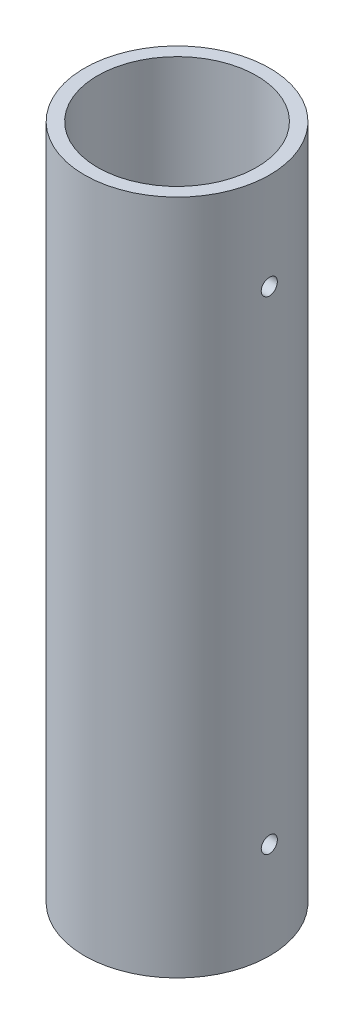
ISO-10303-21;
HEADER;
FILE_DESCRIPTION(('STEP AP214'),'2;1');
FILE_NAME('part.step','',(''),(''),'','','');
FILE_SCHEMA(('AUTOMOTIVE_DESIGN { 1 0 10303 214 1 1 1 1 }'));
ENDSEC;
DATA;
#1=APPLICATION_CONTEXT('core data for automotive mechanical design processes');
#2=APPLICATION_PROTOCOL_DEFINITION('international standard','automotive_design',2000,#1);
#3=PRODUCT_CONTEXT('',#1,'mechanical');
#4=PRODUCT('Part','Part','',(#3));
#5=PRODUCT_RELATED_PRODUCT_CATEGORY('part','',(#4));
#6=PRODUCT_DEFINITION_FORMATION('','',#4);
#7=PRODUCT_DEFINITION_CONTEXT('part definition',#1,'design');
#8=PRODUCT_DEFINITION('design','',#6,#7);
#9=PRODUCT_DEFINITION_SHAPE('','',#8);
#10=(LENGTH_UNIT() NAMED_UNIT(*) SI_UNIT(.MILLI.,.METRE.));
#11=(NAMED_UNIT(*) PLANE_ANGLE_UNIT() SI_UNIT($,.RADIAN.));
#12=(NAMED_UNIT(*) SI_UNIT($,.STERADIAN.) SOLID_ANGLE_UNIT());
#13=UNCERTAINTY_MEASURE_WITH_UNIT(LENGTH_MEASURE(1.E-05),#10,'distance_accuracy_value','');
#14=(GEOMETRIC_REPRESENTATION_CONTEXT(3) GLOBAL_UNCERTAINTY_ASSIGNED_CONTEXT((#13)) GLOBAL_UNIT_ASSIGNED_CONTEXT((#10,
#11,#12)) REPRESENTATION_CONTEXT('',''));
#15=CARTESIAN_POINT('',(0.,0.,0.));
#16=DIRECTION('',(0.,0.,1.));
#17=DIRECTION('',(1.,0.,0.));
#18=AXIS2_PLACEMENT_3D('',#15,#16,#17);
#19=CARTESIAN_POINT('',(0.,-266.7,-1.11022302462516E-13));
#20=DIRECTION('',(0.,0.999999999999993,0.));
#21=DIRECTION('',(0.,0.,0.999999999999993));
#22=AXIS2_PLACEMENT_3D('',#19,#20,#21);
#23=CYLINDRICAL_SURFACE('',#22,36.5125);
#24=CARTESIAN_POINT('',(36.3741945787119,-38.1000000000011,-3.17499999999965));
#25=CARTESIAN_POINT('',(36.3741964069724,-37.9220209484427,-3.17499223767874));
#26=CARTESIAN_POINT('',(36.3755149217874,-37.7439214348147,-3.15998434628701));
#27=CARTESIAN_POINT('',(36.3806463320211,-37.3926522233594,-3.10033709359486));
#28=CARTESIAN_POINT('',(36.3844620380761,-37.2194883100919,-3.05566434309936));
#29=CARTESIAN_POINT('',(36.394152413395,-36.8832285716402,-2.93799093118499));
#30=CARTESIAN_POINT('',(36.4000258988483,-36.7201270210372,-2.86500655445213));
#31=CARTESIAN_POINT('',(36.4131685644205,-36.4085275204711,-2.69281109939546));
#32=CARTESIAN_POINT('',(36.4204374503569,-36.2600265023422,-2.59360554743766));
#33=CARTESIAN_POINT('',(36.4355745979225,-35.9813920765214,-2.37148592362376));
#34=CARTESIAN_POINT('',(36.4434442954007,-35.8513049339295,-2.24851390777006));
#35=CARTESIAN_POINT('',(36.4588832259313,-35.613588625558,-1.98247498338722));
#36=CARTESIAN_POINT('',(36.466452445721,-35.5059604501944,-1.83940718912148));
#37=CARTESIAN_POINT('',(36.4804513186563,-35.3160618687433,-1.53696010977603));
#38=CARTESIAN_POINT('',(36.4868791559379,-35.2338317182659,-1.37755545804974));
#39=CARTESIAN_POINT('',(36.4978555128193,-35.0973208939234,-1.04713634475513));
#40=CARTESIAN_POINT('',(36.5024040679158,-35.0430396921409,-0.87612210254515));
#41=CARTESIAN_POINT('',(36.5090993166084,-34.9641014043957,-0.527800548334798));
#42=CARTESIAN_POINT('',(36.5112521015269,-34.9393691773712,-0.350510384093045));
#43=CARTESIAN_POINT('',(36.5129339083785,-34.919998566389,0.00571683553830769));
#44=CARTESIAN_POINT('',(36.5124629829949,-34.9253595781698,0.184653857787553));
#45=CARTESIAN_POINT('',(36.5089554471739,-34.9659619065122,0.538585809560891));
#46=CARTESIAN_POINT('',(36.5059257748989,-35.0011224212273,0.713590086833769));
#47=CARTESIAN_POINT('',(36.4976494344219,-35.1001999894299,1.0552037567847));
#48=CARTESIAN_POINT('',(36.4924027435441,-35.1641173370455,1.22181306357867));
#49=CARTESIAN_POINT('',(36.4802706070642,-35.3189839523703,1.5421639969502));
#50=CARTESIAN_POINT('',(36.4733829754146,-35.4099693204288,1.69588808546635));
#51=CARTESIAN_POINT('',(36.4587427444671,-35.6163630245248,1.98591351092084));
#52=CARTESIAN_POINT('',(36.4509901260433,-35.7317719006428,2.12221446247202));
#53=CARTESIAN_POINT('',(36.4354606495048,-35.9841917951939,2.37399713886373));
#54=CARTESIAN_POINT('',(36.4276837960808,-36.1212730413492,2.48940847013833));
#55=CARTESIAN_POINT('',(36.4130081143365,-36.4129019548663,2.69559172673827));
#56=CARTESIAN_POINT('',(36.4061092868369,-36.5674496385539,2.78636362903308));
#57=CARTESIAN_POINT('',(36.3939696389523,-36.8896747549541,2.94068913898403));
#58=CARTESIAN_POINT('',(36.388729049679,-37.0573540137784,3.00423895308614));
#59=CARTESIAN_POINT('',(36.3805038227307,-37.4010582653507,3.10226350008524));
#60=CARTESIAN_POINT('',(36.3775191333504,-37.5770830667204,3.1367388993705));
#61=CARTESIAN_POINT('',(36.3741521666384,-37.9318653246311,3.17554658314364));
#62=CARTESIAN_POINT('',(36.3737614088203,-38.1106119593938,3.17997709609324));
#63=CARTESIAN_POINT('',(36.3756041671422,-38.4663053373545,3.15882668312564));
#64=CARTESIAN_POINT('',(36.3778376565952,-38.6432520988376,3.13324606240327));
#65=CARTESIAN_POINT('',(36.3846695239537,-38.9900399900931,3.05288147123359));
#66=CARTESIAN_POINT('',(36.389264179366,-39.1598918509087,2.99814346387842));
#67=CARTESIAN_POINT('',(36.4002976067163,-39.4880011145497,2.86106467628365));
#68=CARTESIAN_POINT('',(36.4067364108219,-39.646258315068,2.77872341455431));
#69=CARTESIAN_POINT('',(36.4207532017477,-39.9471350598904,2.58852742866517));
#70=CARTESIAN_POINT('',(36.4283340895122,-40.0897131355067,2.48060732097235));
#71=CARTESIAN_POINT('',(36.4437711314693,-40.3547649615016,2.24241138363842));
#72=CARTESIAN_POINT('',(36.4516272908142,-40.4772383353415,2.11213513538498));
#73=CARTESIAN_POINT('',(36.4667550092637,-40.6989401730446,1.83250016835367));
#74=CARTESIAN_POINT('',(36.4740249269046,-40.7981047627762,1.68309070747005));
#75=CARTESIAN_POINT('',(36.4871373336795,-40.9699355930353,1.36968288323859));
#76=CARTESIAN_POINT('',(36.4929798381626,-41.042602118502,1.20568467679011));
#77=CARTESIAN_POINT('',(36.5025716028831,-41.1592646848333,0.867982349778373));
#78=CARTESIAN_POINT('',(36.5063237323204,-41.2033000381238,0.694291894857699));
#79=CARTESIAN_POINT('',(36.511323659952,-41.2615787077319,0.34194856943701));
#80=CARTESIAN_POINT('',(36.5125715101824,-41.2758226430812,0.163295802126354));
#81=CARTESIAN_POINT('',(36.5124223397014,-41.2741066310721,-0.193271691564553));
#82=CARTESIAN_POINT('',(36.511034028917,-41.258246149358,-0.371186908713194));
#83=CARTESIAN_POINT('',(36.5057857381011,-41.196979177349,-0.721816344792293));
#84=CARTESIAN_POINT('',(36.501925754965,-41.1515726499427,-0.894530557189691));
#85=CARTESIAN_POINT('',(36.492167080476,-41.0325282743742,-1.22986020903324));
#86=CARTESIAN_POINT('',(36.4862685353901,-40.9588924516247,-1.39247637202792));
#87=CARTESIAN_POINT('',(36.473092152623,-40.7854909215865,-1.70305476347802));
#88=CARTESIAN_POINT('',(36.4658143339545,-40.6857255744766,-1.85101719388706));
#89=CARTESIAN_POINT('',(36.4506672987472,-40.4625234690787,-2.12859732583253));
#90=CARTESIAN_POINT('',(36.4427962875014,-40.339012966056,-2.2581556313287));
#91=CARTESIAN_POINT('',(36.4273652627132,-40.0719630884367,-2.49475723007935));
#92=CARTESIAN_POINT('',(36.4198053248018,-39.9284188798808,-2.60179507366438));
#93=CARTESIAN_POINT('',(36.4058360205555,-39.6250736854981,-2.79047604272186));
#94=CARTESIAN_POINT('',(36.3994289930184,-39.4652406618243,-2.87206778845395));
#95=CARTESIAN_POINT('',(36.388519306995,-39.1341952474858,-3.00715047911602));
#96=CARTESIAN_POINT('',(36.3840144685756,-38.9629961444134,-3.06067360815973));
#97=CARTESIAN_POINT('',(36.3785732488344,-38.6756625224093,-3.12452531560611));
#98=CARTESIAN_POINT('',(36.3769388392626,-38.5613738775411,-3.14342801946827));
#99=CARTESIAN_POINT('',(36.3747489114024,-38.3314071299448,-3.16866786665855));
#100=CARTESIAN_POINT('',(36.3741933899045,-38.2157290313512,-3.17500504736827));
#101=CARTESIAN_POINT('',(36.3741945787119,-38.1000000000011,-3.17499999999965));
#102=B_SPLINE_CURVE_WITH_KNOTS('',3,(#24,#25,#26,#27,#28,#29,#30,#31,#32,#33,#34,#35,#36,#37,
#38,#39,#40,#41,#42,#43,#44,#45,#46,#47,#48,#49,#50,#51,#52,#53,#54,#55,#56,#57,#58,#59,#60,#61,
#62,#63,#64,#65,#66,#67,#68,#69,#70,#71,#72,#73,#74,#75,#76,#77,#78,#79,#80,#81,#82,#83,#84,#85,
#86,#87,#88,#89,#90,#91,#92,#93,#94,#95,#96,#97,#98,#99,#100,#101),.UNSPECIFIED.,.T.,.F.,(4,2,2,
2,2,2,2,2,2,2,2,2,2,2,2,2,2,2,2,2,2,2,2,2,2,2,2,2,2,2,2,2,2,2,2,2,2,2,4),(0.,0.533514591677766,
1.0676306992763,1.60144004079251,2.13513696641946,2.67015187512738,3.20519037242478,
3.74107259928876,4.27694470369942,4.81145120102616,5.34594696569034,5.87899805596258,
6.41205459846518,6.94582528484502,7.47960777580354,8.01515680663147,8.55070633803687,
9.08633047707911,9.62194233923339,10.1558022292963,10.6896566903783,11.2226720742265,
11.7556967560652,12.2900989127025,12.8245110769591,13.3603710727916,13.8962253062417,
14.4313422151079,14.9664480047442,15.4997888703335,16.0331304058322,16.566433681979,
17.0997296072673,17.6347093425764,18.169818387756,18.7060010111152,19.241567483591,
19.5884808424829,19.9353931693288),.UNSPECIFIED.);
#103=CARTESIAN_POINT('',(36.3741945787119,-38.1000000000011,-3.17499999999965));
#104=VERTEX_POINT('',#103);
#105=EDGE_CURVE('E100',#104,#104,#102,.T.);
#106=ORIENTED_EDGE('',*,*,#105,.F.);
#107=EDGE_LOOP('',(#106));
#108=FACE_BOUND('',#107,.T.);
#109=CARTESIAN_POINT('',(36.374194578712,-228.6,-3.17499999999976));
#110=CARTESIAN_POINT('',(36.3741964069725,-228.422020948442,-3.17499223767897));
#111=CARTESIAN_POINT('',(36.3755149217874,-228.243921434814,-3.15998434628718));
#112=CARTESIAN_POINT('',(36.380646332021,-227.892652223358,-3.10033709359495));
#113=CARTESIAN_POINT('',(36.3844620380761,-227.71948831009,-3.05566434309942));
#114=CARTESIAN_POINT('',(36.3941524133951,-227.383228571638,-2.93799093118513));
#115=CARTESIAN_POINT('',(36.4000258988484,-227.220127021035,-2.86500655445243));
#116=CARTESIAN_POINT('',(36.4131685644204,-226.90852752047,-2.69281109939524));
#117=CARTESIAN_POINT('',(36.4204374503569,-226.760026502342,-2.59360554743677));
#118=CARTESIAN_POINT('',(36.4355745979225,-226.481392076521,-2.37148592362293));
#119=CARTESIAN_POINT('',(36.4434442954007,-226.351304933928,-2.24851390776999));
#120=CARTESIAN_POINT('',(36.4588832259313,-226.113588625557,-1.98247498338781));
#121=CARTESIAN_POINT('',(36.466452445721,-226.005960450194,-1.839407189122));
#122=CARTESIAN_POINT('',(36.4804513186562,-225.816061868742,-1.53696010977675));
#123=CARTESIAN_POINT('',(36.4868791559379,-225.733831718265,-1.37755545805073));
#124=CARTESIAN_POINT('',(36.4978555128193,-225.597320893923,-1.04713634475617));
#125=CARTESIAN_POINT('',(36.5024040679158,-225.543039692141,-0.876122102545967));
#126=CARTESIAN_POINT('',(36.5090993166085,-225.464101404395,-0.527800548335387));
#127=CARTESIAN_POINT('',(36.5112521015269,-225.43936917737,-0.350510384093622));
#128=CARTESIAN_POINT('',(36.5129339083785,-225.419998566388,0.00571683553777545));
#129=CARTESIAN_POINT('',(36.5124629829949,-225.425359578169,0.184653857787053));
#130=CARTESIAN_POINT('',(36.5089554471739,-225.465961906512,0.538585809560779));
#131=CARTESIAN_POINT('',(36.5059257748988,-225.501122421226,0.713590086834011));
#132=CARTESIAN_POINT('',(36.4976494344219,-225.600199989429,1.05520375678501));
#133=CARTESIAN_POINT('',(36.4924027435441,-225.664117337046,1.22181306357869));
#134=CARTESIAN_POINT('',(36.4802706070641,-225.818983952371,1.54216399695044));
#135=CARTESIAN_POINT('',(36.4733829754145,-225.909969320428,1.69588808546711));
#136=CARTESIAN_POINT('',(36.458742744467,-226.116363024524,1.98591351092186));
#137=CARTESIAN_POINT('',(36.4509901260434,-226.231771900642,2.12221446247277));
#138=CARTESIAN_POINT('',(36.4354606495048,-226.484191795193,2.37399713886433));
#139=CARTESIAN_POINT('',(36.4276837960807,-226.621273041348,2.48940847013902));
#140=CARTESIAN_POINT('',(36.4130081143367,-226.912901954866,2.69559172673837));
#141=CARTESIAN_POINT('',(36.4061092868375,-227.067449638554,2.78636362903247));
#142=CARTESIAN_POINT('',(36.3939696389529,-227.389674754954,2.94068913898345));
#143=CARTESIAN_POINT('',(36.388729049679,-227.557354013778,3.00423895308629));
#144=CARTESIAN_POINT('',(36.3805038227306,-227.90105826535,3.10226350008557));
#145=CARTESIAN_POINT('',(36.3775191333509,-228.07708306672,3.13673889937026));
#146=CARTESIAN_POINT('',(36.374152166639,-228.431865324631,3.17554658314299));
#147=CARTESIAN_POINT('',(36.3737614088206,-228.610611959394,3.17997709609273));
#148=CARTESIAN_POINT('',(36.375604167142,-228.966305337355,3.15882668312574));
#149=CARTESIAN_POINT('',(36.3778376565948,-229.143252098838,3.13324606240385));
#150=CARTESIAN_POINT('',(36.3846695239533,-229.490039990093,3.05288147123406));
#151=CARTESIAN_POINT('',(36.3892641793659,-229.659891850908,2.99814346387833));
#152=CARTESIAN_POINT('',(36.4002976067164,-229.988001114549,2.861064676283));
#153=CARTESIAN_POINT('',(36.4067364108221,-230.146258315067,2.77872341455362));
#154=CARTESIAN_POINT('',(36.4207532017478,-230.447135059889,2.58852742866445));
#155=CARTESIAN_POINT('',(36.4283340895122,-230.589713135506,2.4806073209716));
#156=CARTESIAN_POINT('',(36.4437711314693,-230.854764961501,2.24241138363774));
#157=CARTESIAN_POINT('',(36.4516272908142,-230.977238335341,2.11213513538441));
#158=CARTESIAN_POINT('',(36.4667550092637,-231.198940173044,1.83250016835297));
#159=CARTESIAN_POINT('',(36.4740249269046,-231.298104762775,1.68309070746917));
#160=CARTESIAN_POINT('',(36.4871373336795,-231.469935593034,1.36968288323808));
#161=CARTESIAN_POINT('',(36.4929798381626,-231.542602118502,1.20568467679015));
#162=CARTESIAN_POINT('',(36.5025716028831,-231.659264684833,0.867982349778619));
#163=CARTESIAN_POINT('',(36.5063237323204,-231.703300038122,0.694291894857583));
#164=CARTESIAN_POINT('',(36.511323659952,-231.761578707731,0.341948569436542));
#165=CARTESIAN_POINT('',(36.5125715101824,-231.775822643081,0.163295802125897));
#166=CARTESIAN_POINT('',(36.5124223397014,-231.774106631072,-0.19327169156468));
#167=CARTESIAN_POINT('',(36.511034028917,-231.758246149357,-0.371186908713002));
#168=CARTESIAN_POINT('',(36.5057857381011,-231.696979177348,-0.721816344791825));
#169=CARTESIAN_POINT('',(36.501925754965,-231.651572649942,-0.894530557189267));
#170=CARTESIAN_POINT('',(36.492167080476,-231.532528274374,-1.22986020903271));
#171=CARTESIAN_POINT('',(36.4862685353901,-231.458892451624,-1.39247637202722));
#172=CARTESIAN_POINT('',(36.473092152623,-231.285490921585,-1.70305476347773));
#173=CARTESIAN_POINT('',(36.4658143339546,-231.185725574476,-1.85101719388734));
#174=CARTESIAN_POINT('',(36.4506672987472,-230.962523469078,-2.12859732583268));
#175=CARTESIAN_POINT('',(36.4427962875014,-230.839012966055,-2.25815563132819));
#176=CARTESIAN_POINT('',(36.4273652627133,-230.571963088436,-2.49475723007872));
#177=CARTESIAN_POINT('',(36.4198053248019,-230.428418879881,-2.60179507366429));
#178=CARTESIAN_POINT('',(36.4058360205556,-230.125073685499,-2.79047604272182));
#179=CARTESIAN_POINT('',(36.3994289930184,-229.965240661824,-2.87206778845336));
#180=CARTESIAN_POINT('',(36.388519306995,-229.634195247486,-3.00715047911568));
#181=CARTESIAN_POINT('',(36.3840144685758,-229.462996144413,-3.06067360816018));
#182=CARTESIAN_POINT('',(36.3785732488345,-229.175662522409,-3.12452531560655));
#183=CARTESIAN_POINT('',(36.3769388392626,-229.061373877541,-3.14342801946837));
#184=CARTESIAN_POINT('',(36.3747489114024,-228.831407129944,-3.16866786665845));
#185=CARTESIAN_POINT('',(36.3741933899045,-228.715729031351,-3.17500504736831));
#186=CARTESIAN_POINT('',(36.374194578712,-228.6,-3.17499999999976));
#187=B_SPLINE_CURVE_WITH_KNOTS('',3,(#109,#110,#111,#112,#113,#114,#115,#116,#117,#118,#119,
#120,#121,#122,#123,#124,#125,#126,#127,#128,#129,#130,#131,#132,#133,#134,#135,#136,#137,#138,
#139,#140,#141,#142,#143,#144,#145,#146,#147,#148,#149,#150,#151,#152,#153,#154,#155,#156,#157,
#158,#159,#160,#161,#162,#163,#164,#165,#166,#167,#168,#169,#170,#171,#172,#173,#174,#175,#176,
#177,#178,#179,#180,#181,#182,#183,#184,#185,#186),.UNSPECIFIED.,.T.,.F.,(4,2,2,2,2,2,2,2,2,2,2,
2,2,2,2,2,2,2,2,2,2,2,2,2,2,2,2,2,2,2,2,2,2,2,2,2,2,2,4),(0.,0.533514591678455,1.06763069927752,
1.60144004079339,2.13513696642024,2.6701518751278,3.20519037242459,3.7410725992883,
4.27694470369893,4.81145120102612,5.34594696569051,5.87899805596313,6.41205459846636,
6.94582528484622,7.4796077758045,8.01515680663226,8.55070633803769,9.08633047708017,
9.62194233923461,10.1558022292975,10.6896566903794,11.222672074227,11.7556967560652,
12.2900989127032,12.8245110769603,13.3603710727921,13.8962253062416,14.4313422151082,
14.9664480047447,15.4997888703333,16.0331304058314,16.5664336819788,17.0997296072676,
17.634709342576,18.1698183877549,18.7060010111144,19.2415674835905,19.5884808424826,
19.9353931693288),.UNSPECIFIED.);
#188=CARTESIAN_POINT('',(36.374194578712,-228.6,-3.17499999999976));
#189=VERTEX_POINT('',#188);
#190=EDGE_CURVE('E53',#189,#189,#187,.T.);
#191=ORIENTED_EDGE('',*,*,#190,.F.);
#192=EDGE_LOOP('',(#191));
#193=FACE_BOUND('',#192,.T.);
#194=CARTESIAN_POINT('',(0.,-266.7,-1.11022302462516E-13));
#195=DIRECTION('',(0.,0.999999999999993,0.));
#196=DIRECTION('',(0.,0.,0.999999999999993));
#197=AXIS2_PLACEMENT_3D('',#194,#195,#196);
#198=CIRCLE('',#197,36.5125);
#199=CARTESIAN_POINT('',(0.,-266.7,36.5124999999996));
#200=VERTEX_POINT('',#199);
#201=EDGE_CURVE('E10',#200,#200,#198,.T.);
#202=ORIENTED_EDGE('',*,*,#201,.T.);
#203=EDGE_LOOP('',(#202));
#204=FACE_BOUND('',#203,.T.);
#205=CARTESIAN_POINT('',(0.,0.,0.));
#206=DIRECTION('',(0.,0.999999999999993,0.));
#207=DIRECTION('',(0.,0.,0.999999999999993));
#208=AXIS2_PLACEMENT_3D('',#205,#206,#207);
#209=CIRCLE('',#208,36.5125);
#210=CARTESIAN_POINT('',(0.,0.,36.5124999999997));
#211=VERTEX_POINT('',#210);
#212=EDGE_CURVE('E41',#211,#211,#209,.T.);
#213=ORIENTED_EDGE('',*,*,#212,.F.);
#214=EDGE_LOOP('',(#213));
#215=FACE_BOUND('',#214,.T.);
#216=ADVANCED_FACE('F37',(#108,#193,#204,#215),#23,.T.);
#217=CARTESIAN_POINT('',(0.,-266.7,-1.11022302462516E-13));
#218=DIRECTION('',(0.,0.999999999999993,0.));
#219=DIRECTION('',(0.,0.,0.999999999999993));
#220=AXIS2_PLACEMENT_3D('',#217,#218,#219);
#221=PLANE('',#220);
#222=CARTESIAN_POINT('',(0.,-266.7,-1.11022302462516E-13));
#223=DIRECTION('',(0.,0.999999999999993,0.));
#224=DIRECTION('',(0.,0.,0.999999999999993));
#225=AXIS2_PLACEMENT_3D('',#222,#223,#224);
#226=CIRCLE('',#225,31.3563);
#227=CARTESIAN_POINT('',(0.,-266.7,31.3562999999997));
#228=VERTEX_POINT('',#227);
#229=EDGE_CURVE('E48',#228,#228,#226,.T.);
#230=ORIENTED_EDGE('',*,*,#229,.T.);
#231=EDGE_LOOP('',(#230));
#232=FACE_BOUND('',#231,.T.);
#233=ORIENTED_EDGE('',*,*,#201,.F.);
#234=EDGE_LOOP('',(#233));
#235=FACE_BOUND('',#234,.T.);
#236=ADVANCED_FACE('F84',(#232,#235),#221,.F.);
#237=CARTESIAN_POINT('',(0.,0.,0.));
#238=DIRECTION('',(0.,0.999999999999993,0.));
#239=DIRECTION('',(0.,0.,0.999999999999993));
#240=AXIS2_PLACEMENT_3D('',#237,#238,#239);
#241=PLANE('',#240);
#242=CARTESIAN_POINT('',(0.,0.,0.));
#243=DIRECTION('',(0.,0.999999999999993,0.));
#244=DIRECTION('',(0.,0.,0.999999999999993));
#245=AXIS2_PLACEMENT_3D('',#242,#243,#244);
#246=CIRCLE('',#245,31.3563);
#247=CARTESIAN_POINT('',(0.,0.,31.3562999999998));
#248=VERTEX_POINT('',#247);
#249=EDGE_CURVE('E50',#248,#248,#246,.T.);
#250=ORIENTED_EDGE('',*,*,#249,.F.);
#251=EDGE_LOOP('',(#250));
#252=FACE_BOUND('',#251,.T.);
#253=ORIENTED_EDGE('',*,*,#212,.T.);
#254=EDGE_LOOP('',(#253));
#255=FACE_BOUND('',#254,.T.);
#256=ADVANCED_FACE('F82',(#252,#255),#241,.T.);
#257=CARTESIAN_POINT('',(0.,-266.7,-1.11022302462516E-13));
#258=DIRECTION('',(0.,0.999999999999993,0.));
#259=DIRECTION('',(0.,0.,0.999999999999993));
#260=AXIS2_PLACEMENT_3D('',#257,#258,#259);
#261=CYLINDRICAL_SURFACE('',#260,31.3563);
#262=CARTESIAN_POINT('',(31.1951426457709,-38.1000000000018,-3.17499999999982));
#263=CARTESIAN_POINT('',(31.1951447555049,-37.9221500054014,-3.17499230182411));
#264=CARTESIAN_POINT('',(31.196679977157,-37.7441827050899,-3.16000606675471));
#265=CARTESIAN_POINT('',(31.202654072943,-37.3931831511084,-3.10044989003051));
#266=CARTESIAN_POINT('',(31.2070961394983,-37.2201565418102,-3.05584742176837));
#267=CARTESIAN_POINT('',(31.2183757208367,-36.8841721510875,-2.93837160985966));
#268=CARTESIAN_POINT('',(31.2252117753509,-36.7212083027675,-2.86551549728028));
#269=CARTESIAN_POINT('',(31.2405072873516,-36.4098571523131,-2.69363378635053));
#270=CARTESIAN_POINT('',(31.2489664243515,-36.2614669812555,-2.59461335283793));
#271=CARTESIAN_POINT('',(31.2665902620922,-35.9828877496841,-2.37281765717636));
#272=CARTESIAN_POINT('',(31.2757572073306,-35.8527606126262,-2.24996478880694));
#273=CARTESIAN_POINT('',(31.2937434108409,-35.614934576374,-1.98415745504513));
#274=CARTESIAN_POINT('',(31.3025626531289,-35.507236707277,-1.84120206691964));
#275=CARTESIAN_POINT('',(31.3188819623217,-35.3171119692746,-1.53886790109451));
#276=CARTESIAN_POINT('',(31.3263791508065,-35.234739957893,-1.3794544573079));
#277=CARTESIAN_POINT('',(31.3391851867055,-35.0979561492639,-1.04896993498302));
#278=CARTESIAN_POINT('',(31.3444940887081,-35.0435436545383,-0.877899147369492));
#279=CARTESIAN_POINT('',(31.3523096264264,-34.9644052114545,-0.529581983959419));
#280=CARTESIAN_POINT('',(31.3548258648648,-34.9395775123645,-0.352358945040719));
#281=CARTESIAN_POINT('',(31.3568052270592,-34.9199985704922,0.0037552288427589));
#282=CARTESIAN_POINT('',(31.3562684318227,-34.9252465296998,0.182646319422684));
#283=CARTESIAN_POINT('',(31.3522100652063,-34.9655873818437,0.536327729747555));
#284=CARTESIAN_POINT('',(31.3486994364554,-35.000570860461,0.711130672378342));
#285=CARTESIAN_POINT('',(31.3391004916767,-35.0992192197717,1.05237122293161));
#286=CARTESIAN_POINT('',(31.3330121414416,-35.1628844810845,1.21880871980847));
#287=CARTESIAN_POINT('',(31.3189234198531,-35.3172089871133,1.53893843543162));
#288=CARTESIAN_POINT('',(31.3109196275444,-35.4079166011803,1.69260718017228));
#289=CARTESIAN_POINT('',(31.2938979941613,-35.6137158306053,1.98258115902258));
#290=CARTESIAN_POINT('',(31.2848801225934,-35.7288081793074,2.11888587073046));
#291=CARTESIAN_POINT('',(31.2667944393556,-35.9807250609597,2.37090353472261));
#292=CARTESIAN_POINT('',(31.2577265851521,-36.1176447819557,2.48652135500987));
#293=CARTESIAN_POINT('',(31.2406032990587,-36.4089998681463,2.69314663370901));
#294=CARTESIAN_POINT('',(31.2325478686989,-36.5634352598123,2.78415405492643));
#295=CARTESIAN_POINT('',(31.2183607947102,-36.8855114668986,2.93897497458629));
#296=CARTESIAN_POINT('',(31.2122295724654,-37.0531551647754,3.00278251759848));
#297=CARTESIAN_POINT('',(31.2025937568955,-37.3968527140276,3.10131672601568));
#298=CARTESIAN_POINT('',(31.1990890814823,-37.5729063023829,3.13604430027019));
#299=CARTESIAN_POINT('',(31.1951174001911,-37.9275907325066,3.17531024721307));
#300=CARTESIAN_POINT('',(31.1946369993218,-38.1062066925209,3.1799817450577));
#301=CARTESIAN_POINT('',(31.1967329055636,-38.4616788721816,3.15935262152371));
#302=CARTESIAN_POINT('',(31.1993091703093,-38.6385351161833,3.13405241555148));
#303=CARTESIAN_POINT('',(31.2072159368455,-38.9850790317026,3.0543094758124));
#304=CARTESIAN_POINT('',(31.2125404822768,-39.1547813510497,2.99992975703816));
#305=CARTESIAN_POINT('',(31.2253390291381,-39.4826556395137,2.86363578938112));
#306=CARTESIAN_POINT('',(31.2328130810086,-39.6408273379428,2.78172089434749));
#307=CARTESIAN_POINT('',(31.2491009056069,-39.9417570561722,2.59234862521385));
#308=CARTESIAN_POINT('',(31.2579192644525,-40.0844593361008,2.48480307598451));
#309=CARTESIAN_POINT('',(31.275887105009,-40.3498340256197,2.24734862562128));
#310=CARTESIAN_POINT('',(31.2850365951221,-40.4725059265162,2.11743915670278));
#311=CARTESIAN_POINT('',(31.3026762395953,-40.6947971198351,1.83836681266846));
#312=CARTESIAN_POINT('',(31.3111638322062,-40.7943295387392,1.68913455514755));
#313=CARTESIAN_POINT('',(31.3264860119328,-40.9669184529906,1.37599525850984));
#314=CARTESIAN_POINT('',(31.3333206221942,-41.0399753190663,1.21208842491624));
#315=CARTESIAN_POINT('',(31.3445551951503,-41.1573922819284,0.874555284221031));
#316=CARTESIAN_POINT('',(31.3489595986862,-41.2018047473578,0.700947348316262));
#317=CARTESIAN_POINT('',(31.3548557293249,-41.2608430893841,0.348691672073009));
#318=CARTESIAN_POINT('',(31.3563475405019,-41.2754698257691,0.170044077359106));
#319=CARTESIAN_POINT('',(31.3562503401551,-41.2745092449721,-0.186366688996665));
#320=CARTESIAN_POINT('',(31.3546750759099,-41.2590567493226,-0.364130243119691));
#321=CARTESIAN_POINT('',(31.3486478619467,-41.1986591828538,-0.714522301602518));
#322=CARTESIAN_POINT('',(31.3441959101285,-41.1537140905034,-0.887150802213369));
#323=CARTESIAN_POINT('',(31.3329140897501,-41.0356447385978,-1.22237066402916));
#324=CARTESIAN_POINT('',(31.326084563795,-40.9625245388746,-1.38496346739223));
#325=CARTESIAN_POINT('',(31.3108086567104,-40.7901949338423,-1.69558947929486));
#326=CARTESIAN_POINT('',(31.3023622837257,-40.6909856599573,-1.8436227611731));
#327=CARTESIAN_POINT('',(31.2847534952387,-40.4687888008855,-2.1216184532942));
#328=CARTESIAN_POINT('',(31.2755881574173,-40.34570082081,-2.25150043639503));
#329=CARTESIAN_POINT('',(31.2575990857575,-40.0794391777772,-2.48882571188733));
#330=CARTESIAN_POINT('',(31.2487754343685,-39.9362607050218,-2.59626361564195));
#331=CARTESIAN_POINT('',(31.2324442206929,-39.6334738371825,-2.78587252089301));
#332=CARTESIAN_POINT('',(31.2249401401311,-39.4738236893622,-2.86797709751238));
#333=CARTESIAN_POINT('',(31.2121391571763,-39.1430281143245,-3.00410323884935));
#334=CARTESIAN_POINT('',(31.2068397705467,-38.9718958790455,-3.05815642880251));
#335=CARTESIAN_POINT('',(31.2003823970188,-38.6831652206826,-3.12319027731325));
#336=CARTESIAN_POINT('',(31.1984268043513,-38.5674116817355,-3.14259230936812));
#337=CARTESIAN_POINT('',(31.195806236068,-38.3344557534437,-3.16849968040894));
#338=CARTESIAN_POINT('',(31.1951412548604,-38.2172533703786,-3.17500507527153));
#339=CARTESIAN_POINT('',(31.1951426457709,-38.1000000000018,-3.17499999999982));
#340=B_SPLINE_CURVE_WITH_KNOTS('',3,(#262,#263,#264,#265,#266,#267,#268,#269,#270,#271,#272,
#273,#274,#275,#276,#277,#278,#279,#280,#281,#282,#283,#284,#285,#286,#287,#288,#289,#290,#291,
#292,#293,#294,#295,#296,#297,#298,#299,#300,#301,#302,#303,#304,#305,#306,#307,#308,#309,#310,
#311,#312,#313,#314,#315,#316,#317,#318,#319,#320,#321,#322,#323,#324,#325,#326,#327,#328,#329,
#330,#331,#332,#333,#334,#335,#336,#337,#338,#339),.UNSPECIFIED.,.T.,.F.,(4,2,2,2,2,2,2,2,2,2,2,
2,2,2,2,2,2,2,2,2,2,2,2,2,2,2,2,2,2,2,2,2,2,2,2,2,2,2,4),(0.,0.533121788184988,1.06683005838771,
1.60021334619331,2.13349142267812,2.66853609517213,3.20360533496806,3.73982553584846,
4.27603235952808,4.8103896393496,5.34473274091181,5.87711815188715,6.40951062805217,
6.94286114127399,7.47622769670704,8.0119872851548,8.5477476833081,9.08362532635731,
9.61948622075357,10.152972022652,10.686450430549,11.2187774535191,11.7511169691482,
12.2853149809103,12.8195265571171,13.3557124751478,13.8918908848583,14.4270862357209,
14.9622661375359,15.4950527717235,16.0278397948732,16.5605500759039,17.0932576734485,
17.6282555077017,18.1633816432349,18.6998992030923,19.2358105698138,19.587289901954,
19.9387677112532),.UNSPECIFIED.);
#341=CARTESIAN_POINT('',(31.1951426457709,-38.1000000000018,-3.17499999999982));
#342=VERTEX_POINT('',#341);
#343=EDGE_CURVE('E108',#342,#342,#340,.T.);
#344=ORIENTED_EDGE('',*,*,#343,.T.);
#345=EDGE_LOOP('',(#344));
#346=FACE_BOUND('',#345,.T.);
#347=CARTESIAN_POINT('',(31.195142645771,-228.6,-3.17499999999976));
#348=CARTESIAN_POINT('',(31.1951447555051,-228.4221500054,-3.17499230182411));
#349=CARTESIAN_POINT('',(31.196679977157,-228.244182705088,-3.16000606675503));
#350=CARTESIAN_POINT('',(31.2026540729429,-227.893183151107,-3.10044989003042));
#351=CARTESIAN_POINT('',(31.2070961394983,-227.720156541809,-3.05584742176757));
#352=CARTESIAN_POINT('',(31.2183757208367,-227.384172151086,-2.93837160985902));
#353=CARTESIAN_POINT('',(31.2252117753508,-227.221208302767,-2.86551549728058));
#354=CARTESIAN_POINT('',(31.2405072873515,-226.909857152313,-2.6936337863513));
#355=CARTESIAN_POINT('',(31.2489664243515,-226.761466981256,-2.59461335283826));
#356=CARTESIAN_POINT('',(31.2665902620921,-226.482887749685,-2.37281765717708));
#357=CARTESIAN_POINT('',(31.2757572073305,-226.352760612626,-2.24996478880849));
#358=CARTESIAN_POINT('',(31.2937434108408,-226.114934576374,-1.98415745504681));
#359=CARTESIAN_POINT('',(31.3025626531289,-226.007236707278,-1.84120206692063));
#360=CARTESIAN_POINT('',(31.3188819623218,-225.817111969275,-1.53886790109549));
#361=CARTESIAN_POINT('',(31.3263791508065,-225.734739957892,-1.37945445730954));
#362=CARTESIAN_POINT('',(31.3391851867055,-225.597956149263,-1.04896993498466));
#363=CARTESIAN_POINT('',(31.3444940887081,-225.543543654539,-0.87789914737047));
#364=CARTESIAN_POINT('',(31.3523096264264,-225.464405211455,-0.529581983959834));
#365=CARTESIAN_POINT('',(31.3548258648648,-225.439577512363,-0.352358945041226));
#366=CARTESIAN_POINT('',(31.3568052270592,-225.41999857049,0.00375522884228757));
#367=CARTESIAN_POINT('',(31.3562684318227,-225.425246529699,0.18264631942234));
#368=CARTESIAN_POINT('',(31.3522100652063,-225.465587381843,0.536327729747397));
#369=CARTESIAN_POINT('',(31.3486994364554,-225.500570860459,0.711130672378246));
#370=CARTESIAN_POINT('',(31.3391004916767,-225.59921921977,1.05237122293086));
#371=CARTESIAN_POINT('',(31.3330121414416,-225.662884481085,1.21880871980702));
#372=CARTESIAN_POINT('',(31.3189234198531,-225.817208987113,1.53893843543061));
#373=CARTESIAN_POINT('',(31.3109196275444,-225.907916601179,1.69260718017239));
#374=CARTESIAN_POINT('',(31.2938979941613,-226.113715830604,1.9825811590229));
#375=CARTESIAN_POINT('',(31.2848801225934,-226.228808179308,2.11888587072986));
#376=CARTESIAN_POINT('',(31.2667944393556,-226.48072506096,2.37090353472204));
#377=CARTESIAN_POINT('',(31.2577265851521,-226.617644781955,2.48652135501027));
#378=CARTESIAN_POINT('',(31.2406032990587,-226.908999868146,2.69314663370969));
#379=CARTESIAN_POINT('',(31.2325478686989,-227.063435259812,2.78415405492643));
#380=CARTESIAN_POINT('',(31.2183607947102,-227.385511466898,2.93897497458588));
#381=CARTESIAN_POINT('',(31.2122295724654,-227.553155164775,3.00278251759833));
#382=CARTESIAN_POINT('',(31.2025937568955,-227.896852714027,3.10131672601622));
#383=CARTESIAN_POINT('',(31.1990890814822,-228.072906302382,3.13604430027115));
#384=CARTESIAN_POINT('',(31.1951174001911,-228.427590732506,3.17531024721377));
#385=CARTESIAN_POINT('',(31.194636999322,-228.60620669252,3.17998174505775));
#386=CARTESIAN_POINT('',(31.1967329055635,-228.961678872181,3.15935262152335));
#387=CARTESIAN_POINT('',(31.1993091703089,-229.138535116183,3.13405241555136));
#388=CARTESIAN_POINT('',(31.2072159368451,-229.485079031702,3.05430947581239));
#389=CARTESIAN_POINT('',(31.2125404822767,-229.654781351049,2.999929757038));
#390=CARTESIAN_POINT('',(31.2253390291383,-229.982655639513,2.86363578938048));
#391=CARTESIAN_POINT('',(31.2328130810087,-230.140827337942,2.78172089434653));
#392=CARTESIAN_POINT('',(31.2491009056069,-230.441757056171,2.59234862521276));
#393=CARTESIAN_POINT('',(31.2579192644525,-230.5844593361,2.48480307598364));
#394=CARTESIAN_POINT('',(31.275887105009,-230.849834025619,2.24734862562104));
#395=CARTESIAN_POINT('',(31.2850365951222,-230.972505926516,2.11743915670296));
#396=CARTESIAN_POINT('',(31.3026762395953,-231.194797119834,1.83836681266854));
#397=CARTESIAN_POINT('',(31.3111638322062,-231.294329538737,1.6891345551471));
#398=CARTESIAN_POINT('',(31.3264860119328,-231.46691845299,1.37599525850954));
#399=CARTESIAN_POINT('',(31.3333206221942,-231.539975319067,1.21208842491663));
#400=CARTESIAN_POINT('',(31.3445551951503,-231.657392281929,0.874555284221633));
#401=CARTESIAN_POINT('',(31.3489595986862,-231.701804747357,0.700947348316381));
#402=CARTESIAN_POINT('',(31.3548557293249,-231.760843089382,0.348691672072762));
#403=CARTESIAN_POINT('',(31.3563475405019,-231.775469825769,0.170044077358977));
#404=CARTESIAN_POINT('',(31.3562503401551,-231.774509244972,-0.186366688996652));
#405=CARTESIAN_POINT('',(31.3546750759099,-231.759056749321,-0.364130243119651));
#406=CARTESIAN_POINT('',(31.3486478619467,-231.698659182852,-0.714522301602677));
#407=CARTESIAN_POINT('',(31.3441959101285,-231.653714090503,-0.887150802213754));
#408=CARTESIAN_POINT('',(31.3329140897501,-231.535644738597,-1.22237066402926));
#409=CARTESIAN_POINT('',(31.326084563795,-231.462524538873,-1.38496346739183));
#410=CARTESIAN_POINT('',(31.3108086567104,-231.290194933841,-1.69558947929425));
#411=CARTESIAN_POINT('',(31.3023622837257,-231.190985659957,-1.8436227611728));
#412=CARTESIAN_POINT('',(31.2847534952387,-230.968788800885,-2.12161845329386));
#413=CARTESIAN_POINT('',(31.2755881574173,-230.845700820809,-2.25150043639431));
#414=CARTESIAN_POINT('',(31.2575990857575,-230.579439177776,-2.4888257118871));
#415=CARTESIAN_POINT('',(31.2487754343686,-230.436260705022,-2.59626361564259));
#416=CARTESIAN_POINT('',(31.232444220693,-230.133473837182,-2.78587252089371));
#417=CARTESIAN_POINT('',(31.2249401401311,-229.973823689362,-2.86797709751229));
#418=CARTESIAN_POINT('',(31.2121391571763,-229.643028114324,-3.00410323884896));
#419=CARTESIAN_POINT('',(31.2068397705468,-229.471895879045,-3.05815642880261));
#420=CARTESIAN_POINT('',(31.2003823970189,-229.183165220682,-3.1231902773135));
#421=CARTESIAN_POINT('',(31.1984268043513,-229.067411681735,-3.14259230936825));
#422=CARTESIAN_POINT('',(31.1958062360679,-228.834455753443,-3.1684996804089));
#423=CARTESIAN_POINT('',(31.1951412548605,-228.717253370377,-3.17500507527144));
#424=CARTESIAN_POINT('',(31.195142645771,-228.6,-3.17499999999976));
#425=B_SPLINE_CURVE_WITH_KNOTS('',3,(#347,#348,#349,#350,#351,#352,#353,#354,#355,#356,#357,
#358,#359,#360,#361,#362,#363,#364,#365,#366,#367,#368,#369,#370,#371,#372,#373,#374,#375,#376,
#377,#378,#379,#380,#381,#382,#383,#384,#385,#386,#387,#388,#389,#390,#391,#392,#393,#394,#395,
#396,#397,#398,#399,#400,#401,#402,#403,#404,#405,#406,#407,#408,#409,#410,#411,#412,#413,#414,
#415,#416,#417,#418,#419,#420,#421,#422,#423,#424),.UNSPECIFIED.,.T.,.F.,(4,2,2,2,2,2,2,2,2,2,2,
2,2,2,2,2,2,2,2,2,2,2,2,2,2,2,2,2,2,2,2,2,2,2,2,2,2,2,4),(0.,0.533121788185035,1.06683005838782,
1.60021334619238,2.13349142267612,2.66853609516993,3.20360533496564,3.73982553584633,
4.27603235952636,4.81038963934845,5.34473274091103,5.87711815188588,6.40951062805061,
6.94286114127317,7.47622769670678,8.01198728515438,8.54774768330757,9.08362532635682,
9.61948622075299,10.1529720226513,10.6864504305482,11.2187774535184,11.7511169691475,
12.2853149809094,12.8195265571159,13.3557124751467,13.8918908848572,14.4270862357198,
14.9622661375349,15.4950527717226,16.0278397948724,16.5605500759026,17.0932576734466,
17.6282555077003,18.1633816432339,18.6998992030911,19.2358105698124,19.5872899019531,
19.9387677112527),.UNSPECIFIED.);
#426=CARTESIAN_POINT('',(31.195142645771,-228.6,-3.17499999999976));
#427=VERTEX_POINT('',#426);
#428=EDGE_CURVE('E62',#427,#427,#425,.T.);
#429=ORIENTED_EDGE('',*,*,#428,.T.);
#430=EDGE_LOOP('',(#429));
#431=FACE_BOUND('',#430,.T.);
#432=ORIENTED_EDGE('',*,*,#229,.F.);
#433=EDGE_LOOP('',(#432));
#434=FACE_BOUND('',#433,.T.);
#435=ORIENTED_EDGE('',*,*,#249,.T.);
#436=EDGE_LOOP('',(#435));
#437=FACE_BOUND('',#436,.T.);
#438=ADVANCED_FACE('F73',(#346,#431,#434,#437),#261,.F.);
#439=CARTESIAN_POINT('',(36.5125,-228.600000000001,4.44089209850063E-13));
#440=DIRECTION('',(1.,0.,0.));
#441=DIRECTION('',(0.,0.,-0.999999999999993));
#442=AXIS2_PLACEMENT_3D('',#439,#440,#441);
#443=CYLINDRICAL_SURFACE('',#442,3.175);
#444=ORIENTED_EDGE('',*,*,#190,.T.);
#445=EDGE_LOOP('',(#444));
#446=FACE_BOUND('',#445,.T.);
#447=ORIENTED_EDGE('',*,*,#428,.F.);
#448=EDGE_LOOP('',(#447));
#449=FACE_BOUND('',#448,.T.);
#450=ADVANCED_FACE('F68',(#446,#449),#443,.F.);
#451=CARTESIAN_POINT('',(36.5125000000004,-38.100000000002,5.55111512312578E-13));
#452=DIRECTION('',(1.,0.,0.));
#453=DIRECTION('',(0.,0.,-0.999999999999993));
#454=AXIS2_PLACEMENT_3D('',#451,#452,#453);
#455=CYLINDRICAL_SURFACE('',#454,3.175);
#456=ORIENTED_EDGE('',*,*,#105,.T.);
#457=EDGE_LOOP('',(#456));
#458=FACE_BOUND('',#457,.T.);
#459=ORIENTED_EDGE('',*,*,#343,.F.);
#460=EDGE_LOOP('',(#459));
#461=FACE_BOUND('',#460,.T.);
#462=ADVANCED_FACE('F72',(#458,#461),#455,.F.);
#463=CLOSED_SHELL('',(#216,#236,#256,#438,#450,#462));
#464=MANIFOLD_SOLID_BREP('B2',#463);
#465=ADVANCED_BREP_SHAPE_REPRESENTATION('',(#18,#464),#14);
#466=SHAPE_DEFINITION_REPRESENTATION(#9,#465);
ENDSEC;
END-ISO-10303-21;
